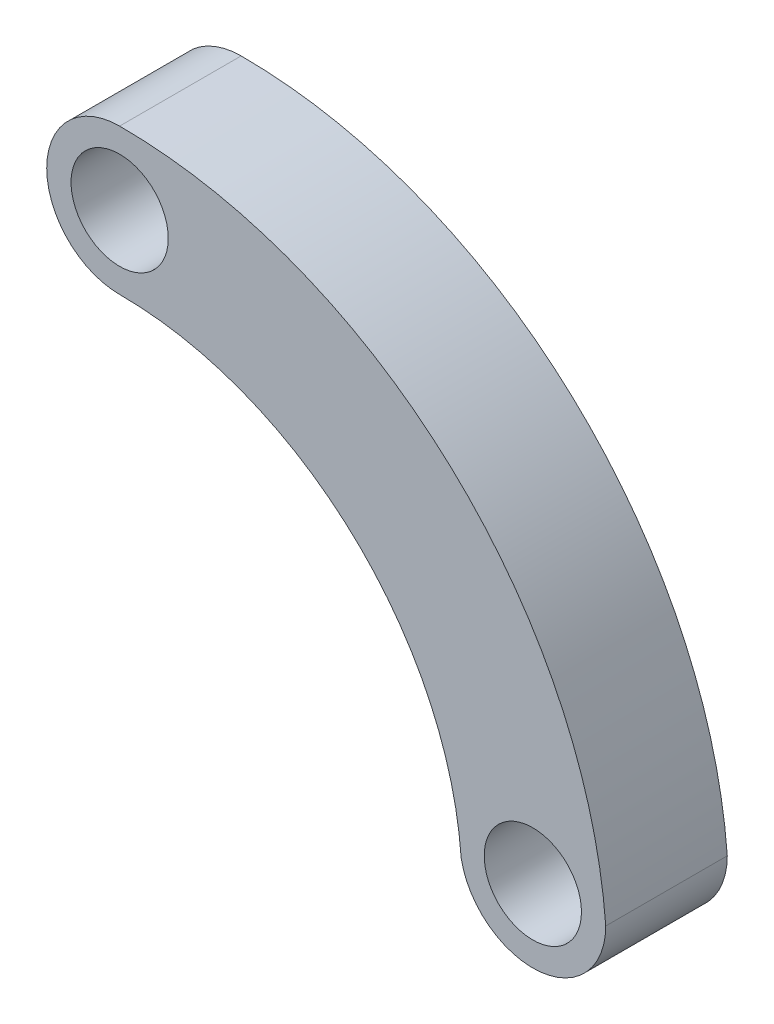
ISO-10303-21;
HEADER;
FILE_DESCRIPTION(('STEP AP214'),'2;1');
FILE_NAME('part.step','',(''),(''),'','','');
FILE_SCHEMA(('AUTOMOTIVE_DESIGN { 1 0 10303 214 1 1 1 1 }'));
ENDSEC;
DATA;
#1=APPLICATION_CONTEXT('core data for automotive mechanical design processes');
#2=APPLICATION_PROTOCOL_DEFINITION('international standard','automotive_design',2000,#1);
#3=PRODUCT_CONTEXT('',#1,'mechanical');
#4=PRODUCT('Part','Part','',(#3));
#5=PRODUCT_RELATED_PRODUCT_CATEGORY('part','',(#4));
#6=PRODUCT_DEFINITION_FORMATION('','',#4);
#7=PRODUCT_DEFINITION_CONTEXT('part definition',#1,'design');
#8=PRODUCT_DEFINITION('design','',#6,#7);
#9=PRODUCT_DEFINITION_SHAPE('','',#8);
#10=(LENGTH_UNIT() NAMED_UNIT(*) SI_UNIT(.MILLI.,.METRE.));
#11=(NAMED_UNIT(*) PLANE_ANGLE_UNIT() SI_UNIT($,.RADIAN.));
#12=(NAMED_UNIT(*) SI_UNIT($,.STERADIAN.) SOLID_ANGLE_UNIT());
#13=UNCERTAINTY_MEASURE_WITH_UNIT(LENGTH_MEASURE(1.E-05),#10,'distance_accuracy_value','');
#14=(GEOMETRIC_REPRESENTATION_CONTEXT(3) GLOBAL_UNCERTAINTY_ASSIGNED_CONTEXT((#13)) GLOBAL_UNIT_ASSIGNED_CONTEXT((#10,
#11,#12)) REPRESENTATION_CONTEXT('',''));
#15=CARTESIAN_POINT('',(0.,0.,0.));
#16=DIRECTION('',(0.,0.,1.));
#17=DIRECTION('',(1.,0.,0.));
#18=AXIS2_PLACEMENT_3D('',#15,#16,#17);
#19=CARTESIAN_POINT('',(-3.94129173741931E-12,-170.900000000004,50.));
#20=DIRECTION('',(0.,0.,-1.));
#21=DIRECTION('',(-1.,0.,0.));
#22=AXIS2_PLACEMENT_3D('',#19,#20,#21);
#23=CYLINDRICAL_SURFACE('',#22,140.900000000004);
#24=CARTESIAN_POINT('',(-3.94129173741931E-12,-170.900000000004,0.));
#25=DIRECTION('',(0.,0.,1.));
#26=DIRECTION('',(1.,0.,0.));
#27=AXIS2_PLACEMENT_3D('',#24,#25,#26);
#28=CIRCLE('',#27,140.900000000004);
#29=CARTESIAN_POINT('',(140.520313479215,-160.563100092238,0.));
#30=VERTEX_POINT('',#29);
#31=CARTESIAN_POINT('',(0.,-30.,0.));
#32=VERTEX_POINT('',#31);
#33=EDGE_CURVE('E117',#30,#32,#28,.T.);
#34=ORIENTED_EDGE('',*,*,#33,.F.);
#35=DIRECTION('',(0.,0.,-1.));
#36=VECTOR('',#35,1.);
#37=CARTESIAN_POINT('',(140.520313479215,-160.563100092238,50.));
#38=LINE('',#37,#36);
#39=CARTESIAN_POINT('',(140.520313479215,-160.563100092238,50.));
#40=VERTEX_POINT('',#39);
#41=EDGE_CURVE('E11',#40,#30,#38,.T.);
#42=ORIENTED_EDGE('',*,*,#41,.F.);
#43=CARTESIAN_POINT('',(-3.94129173741931E-12,-170.900000000004,50.));
#44=DIRECTION('',(0.,0.,1.));
#45=DIRECTION('',(1.,0.,0.));
#46=AXIS2_PLACEMENT_3D('',#43,#44,#45);
#47=CIRCLE('',#46,140.900000000004);
#48=CARTESIAN_POINT('',(0.,-30.,50.));
#49=VERTEX_POINT('',#48);
#50=EDGE_CURVE('E99',#40,#49,#47,.T.);
#51=ORIENTED_EDGE('',*,*,#50,.T.);
#52=DIRECTION('',(0.,0.,-1.));
#53=VECTOR('',#52,1.);
#54=CARTESIAN_POINT('',(0.,-30.,50.));
#55=LINE('',#54,#53);
#56=EDGE_CURVE('E80',#49,#32,#55,.T.);
#57=ORIENTED_EDGE('',*,*,#56,.T.);
#58=EDGE_LOOP('',(#34,#42,#51,#57));
#59=FACE_BOUND('',#58,.T.);
#60=ADVANCED_FACE('F41',(#59),#23,.F.);
#61=CARTESIAN_POINT('',(170.,-155.,50.));
#62=DIRECTION('',(0.,0.,-1.));
#63=DIRECTION('',(-1.,0.,0.));
#64=AXIS2_PLACEMENT_3D('',#61,#62,#63);
#65=CYLINDRICAL_SURFACE('',#64,30.);
#66=CARTESIAN_POINT('',(170.,-155.,0.));
#67=DIRECTION('',(0.,0.,1.));
#68=DIRECTION('',(1.,0.,0.));
#69=AXIS2_PLACEMENT_3D('',#66,#67,#68);
#70=CIRCLE('',#69,30.);
#71=CARTESIAN_POINT('',(200.,-155.,0.));
#72=VERTEX_POINT('',#71);
#73=EDGE_CURVE('E104',#30,#72,#70,.T.);
#74=ORIENTED_EDGE('',*,*,#73,.T.);
#75=DIRECTION('',(0.,0.,-1.));
#76=VECTOR('',#75,1.);
#77=CARTESIAN_POINT('',(200.,-155.,50.));
#78=LINE('',#77,#76);
#79=CARTESIAN_POINT('',(200.,-155.,50.));
#80=VERTEX_POINT('',#79);
#81=EDGE_CURVE('E50',#80,#72,#78,.T.);
#82=ORIENTED_EDGE('',*,*,#81,.F.);
#83=CARTESIAN_POINT('',(170.,-155.,50.));
#84=DIRECTION('',(0.,0.,1.));
#85=DIRECTION('',(1.,0.,0.));
#86=AXIS2_PLACEMENT_3D('',#83,#84,#85);
#87=CIRCLE('',#86,30.);
#88=EDGE_CURVE('E95',#40,#80,#87,.T.);
#89=ORIENTED_EDGE('',*,*,#88,.F.);
#90=ORIENTED_EDGE('',*,*,#41,.T.);
#91=EDGE_LOOP('',(#74,#82,#89,#90));
#92=FACE_BOUND('',#91,.T.);
#93=ADVANCED_FACE('F102',(#92),#65,.T.);
#94=CARTESIAN_POINT('',(0.,-170.608108108108,50.));
#95=DIRECTION('',(0.,0.,-1.));
#96=DIRECTION('',(-1.,0.,0.));
#97=AXIS2_PLACEMENT_3D('',#94,#95,#96);
#98=CYLINDRICAL_SURFACE('',#97,200.608108108108);
#99=CARTESIAN_POINT('',(0.,-170.608108108108,0.));
#100=DIRECTION('',(0.,0.,1.));
#101=DIRECTION('',(1.,0.,0.));
#102=AXIS2_PLACEMENT_3D('',#99,#100,#101);
#103=CIRCLE('',#102,200.608108108108);
#104=CARTESIAN_POINT('',(0.,30.,0.));
#105=VERTEX_POINT('',#104);
#106=EDGE_CURVE('E114',#72,#105,#103,.T.);
#107=ORIENTED_EDGE('',*,*,#106,.T.);
#108=DIRECTION('',(0.,0.,-1.));
#109=VECTOR('',#108,1.);
#110=CARTESIAN_POINT('',(0.,30.,50.));
#111=LINE('',#110,#109);
#112=CARTESIAN_POINT('',(0.,30.,50.));
#113=VERTEX_POINT('',#112);
#114=EDGE_CURVE('E94',#113,#105,#111,.T.);
#115=ORIENTED_EDGE('',*,*,#114,.F.);
#116=CARTESIAN_POINT('',(0.,-170.608108108108,50.));
#117=DIRECTION('',(0.,0.,1.));
#118=DIRECTION('',(1.,0.,0.));
#119=AXIS2_PLACEMENT_3D('',#116,#117,#118);
#120=CIRCLE('',#119,200.608108108108);
#121=EDGE_CURVE('E88',#80,#113,#120,.T.);
#122=ORIENTED_EDGE('',*,*,#121,.F.);
#123=ORIENTED_EDGE('',*,*,#81,.T.);
#124=EDGE_LOOP('',(#107,#115,#122,#123));
#125=FACE_BOUND('',#124,.T.);
#126=ADVANCED_FACE('F91',(#125),#98,.T.);
#127=CARTESIAN_POINT('',(0.,0.,50.));
#128=DIRECTION('',(0.,0.,-1.));
#129=DIRECTION('',(-1.,0.,0.));
#130=AXIS2_PLACEMENT_3D('',#127,#128,#129);
#131=CYLINDRICAL_SURFACE('',#130,30.);
#132=CARTESIAN_POINT('',(0.,0.,0.));
#133=DIRECTION('',(0.,0.,1.));
#134=DIRECTION('',(1.,0.,0.));
#135=AXIS2_PLACEMENT_3D('',#132,#133,#134);
#136=CIRCLE('',#135,30.);
#137=EDGE_CURVE('E73',#105,#32,#136,.T.);
#138=ORIENTED_EDGE('',*,*,#137,.T.);
#139=ORIENTED_EDGE('',*,*,#56,.F.);
#140=CARTESIAN_POINT('',(0.,0.,50.));
#141=DIRECTION('',(0.,0.,1.));
#142=DIRECTION('',(1.,0.,0.));
#143=AXIS2_PLACEMENT_3D('',#140,#141,#142);
#144=CIRCLE('',#143,30.);
#145=EDGE_CURVE('E58',#113,#49,#144,.T.);
#146=ORIENTED_EDGE('',*,*,#145,.F.);
#147=ORIENTED_EDGE('',*,*,#114,.T.);
#148=EDGE_LOOP('',(#138,#139,#146,#147));
#149=FACE_BOUND('',#148,.T.);
#150=ADVANCED_FACE('F151',(#149),#131,.T.);
#151=CARTESIAN_POINT('',(170.,-155.,50.));
#152=DIRECTION('',(0.,0.,-1.));
#153=DIRECTION('',(-1.,0.,0.));
#154=AXIS2_PLACEMENT_3D('',#151,#152,#153);
#155=CYLINDRICAL_SURFACE('',#154,20.);
#156=CARTESIAN_POINT('',(170.,-155.,50.));
#157=DIRECTION('',(0.,0.,1.));
#158=DIRECTION('',(1.,0.,0.));
#159=AXIS2_PLACEMENT_3D('',#156,#157,#158);
#160=CIRCLE('',#159,20.);
#161=CARTESIAN_POINT('',(190.,-155.,50.));
#162=VERTEX_POINT('',#161);
#163=EDGE_CURVE('E112',#162,#162,#160,.T.);
#164=ORIENTED_EDGE('',*,*,#163,.T.);
#165=EDGE_LOOP('',(#164));
#166=FACE_BOUND('',#165,.T.);
#167=CARTESIAN_POINT('',(170.,-155.,0.));
#168=DIRECTION('',(0.,0.,1.));
#169=DIRECTION('',(1.,0.,0.));
#170=AXIS2_PLACEMENT_3D('',#167,#168,#169);
#171=CIRCLE('',#170,20.);
#172=CARTESIAN_POINT('',(190.,-155.,0.));
#173=VERTEX_POINT('',#172);
#174=EDGE_CURVE('E119',#173,#173,#171,.T.);
#175=ORIENTED_EDGE('',*,*,#174,.F.);
#176=EDGE_LOOP('',(#175));
#177=FACE_BOUND('',#176,.T.);
#178=ADVANCED_FACE('F43',(#166,#177),#155,.F.);
#179=CARTESIAN_POINT('',(0.,0.,50.));
#180=DIRECTION('',(0.,0.,-1.));
#181=DIRECTION('',(-1.,0.,0.));
#182=AXIS2_PLACEMENT_3D('',#179,#180,#181);
#183=CYLINDRICAL_SURFACE('',#182,20.);
#184=CARTESIAN_POINT('',(0.,0.,50.));
#185=DIRECTION('',(0.,0.,1.));
#186=DIRECTION('',(1.,0.,0.));
#187=AXIS2_PLACEMENT_3D('',#184,#185,#186);
#188=CIRCLE('',#187,20.);
#189=CARTESIAN_POINT('',(20.,0.,50.));
#190=VERTEX_POINT('',#189);
#191=EDGE_CURVE('E108',#190,#190,#188,.T.);
#192=ORIENTED_EDGE('',*,*,#191,.T.);
#193=EDGE_LOOP('',(#192));
#194=FACE_BOUND('',#193,.T.);
#195=CARTESIAN_POINT('',(0.,0.,0.));
#196=DIRECTION('',(0.,0.,1.));
#197=DIRECTION('',(1.,0.,0.));
#198=AXIS2_PLACEMENT_3D('',#195,#196,#197);
#199=CIRCLE('',#198,20.);
#200=CARTESIAN_POINT('',(20.,0.,0.));
#201=VERTEX_POINT('',#200);
#202=EDGE_CURVE('E109',#201,#201,#199,.T.);
#203=ORIENTED_EDGE('',*,*,#202,.F.);
#204=EDGE_LOOP('',(#203));
#205=FACE_BOUND('',#204,.T.);
#206=ADVANCED_FACE('F133',(#194,#205),#183,.F.);
#207=CARTESIAN_POINT('',(0.,0.,50.));
#208=DIRECTION('',(0.,0.,1.));
#209=DIRECTION('',(1.,0.,0.));
#210=AXIS2_PLACEMENT_3D('',#207,#208,#209);
#211=PLANE('',#210);
#212=ORIENTED_EDGE('',*,*,#163,.F.);
#213=EDGE_LOOP('',(#212));
#214=FACE_BOUND('',#213,.T.);
#215=ORIENTED_EDGE('',*,*,#50,.F.);
#216=ORIENTED_EDGE('',*,*,#88,.T.);
#217=ORIENTED_EDGE('',*,*,#121,.T.);
#218=ORIENTED_EDGE('',*,*,#145,.T.);
#219=EDGE_LOOP('',(#215,#216,#217,#218));
#220=FACE_BOUND('',#219,.T.);
#221=ORIENTED_EDGE('',*,*,#191,.F.);
#222=EDGE_LOOP('',(#221));
#223=FACE_BOUND('',#222,.T.);
#224=ADVANCED_FACE('F97',(#214,#220,#223),#211,.T.);
#225=CARTESIAN_POINT('',(0.,0.,0.));
#226=DIRECTION('',(0.,0.,1.));
#227=DIRECTION('',(1.,0.,0.));
#228=AXIS2_PLACEMENT_3D('',#225,#226,#227);
#229=PLANE('',#228);
#230=ORIENTED_EDGE('',*,*,#174,.T.);
#231=EDGE_LOOP('',(#230));
#232=FACE_BOUND('',#231,.T.);
#233=ORIENTED_EDGE('',*,*,#33,.T.);
#234=ORIENTED_EDGE('',*,*,#137,.F.);
#235=ORIENTED_EDGE('',*,*,#106,.F.);
#236=ORIENTED_EDGE('',*,*,#73,.F.);
#237=EDGE_LOOP('',(#233,#234,#235,#236));
#238=FACE_BOUND('',#237,.T.);
#239=ORIENTED_EDGE('',*,*,#202,.T.);
#240=EDGE_LOOP('',(#239));
#241=FACE_BOUND('',#240,.T.);
#242=ADVANCED_FACE('F132',(#232,#238,#241),#229,.F.);
#243=CLOSED_SHELL('',(#60,#93,#126,#150,#178,#206,#224,#242));
#244=MANIFOLD_SOLID_BREP('B2',#243);
#245=ADVANCED_BREP_SHAPE_REPRESENTATION('',(#18,#244),#14);
#246=SHAPE_DEFINITION_REPRESENTATION(#9,#245);
ENDSEC;
END-ISO-10303-21;
